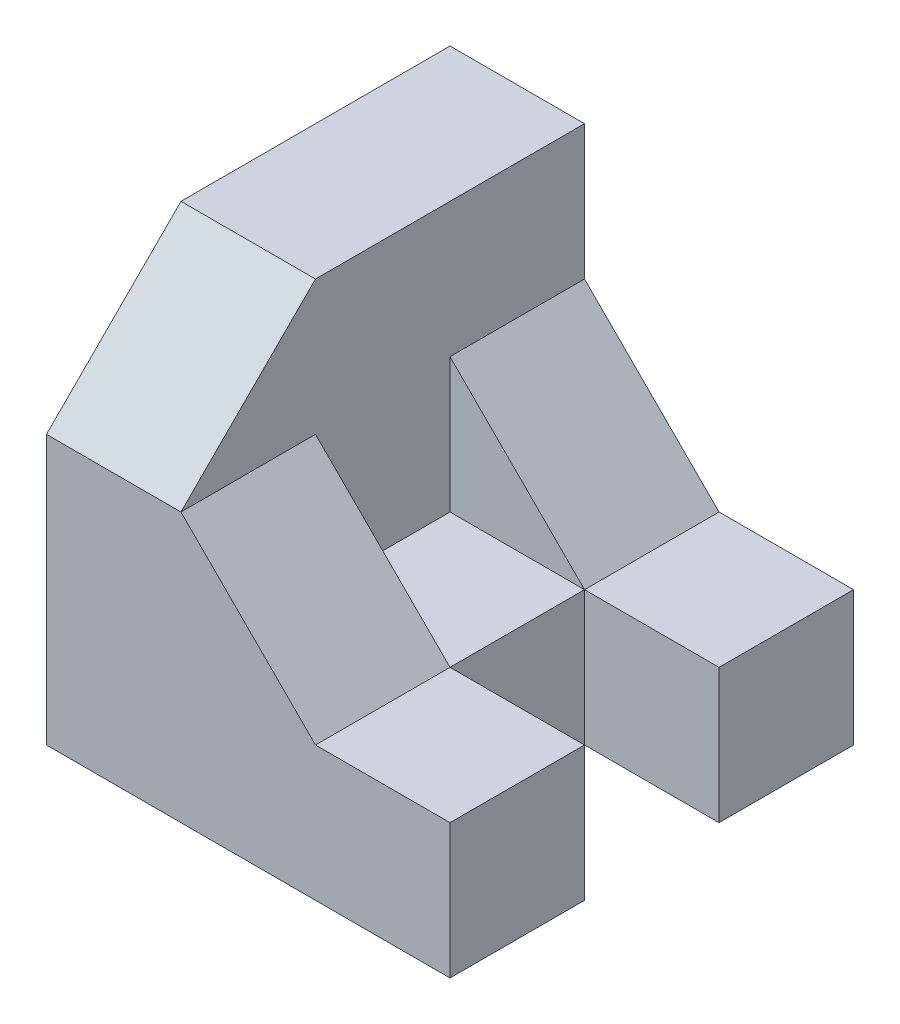
ISO-10303-21;
HEADER;
FILE_DESCRIPTION(('STEP AP214'),'2;1');
FILE_NAME('part.step','',(''),(''),'','','');
FILE_SCHEMA(('AUTOMOTIVE_DESIGN { 1 0 10303 214 1 1 1 1 }'));
ENDSEC;
DATA;
#1=APPLICATION_CONTEXT('core data for automotive mechanical design processes');
#2=APPLICATION_PROTOCOL_DEFINITION('international standard','automotive_design',2000,#1);
#3=PRODUCT_CONTEXT('',#1,'mechanical');
#4=PRODUCT('Part','Part','',(#3));
#5=PRODUCT_RELATED_PRODUCT_CATEGORY('part','',(#4));
#6=PRODUCT_DEFINITION_FORMATION('','',#4);
#7=PRODUCT_DEFINITION_CONTEXT('part definition',#1,'design');
#8=PRODUCT_DEFINITION('design','',#6,#7);
#9=PRODUCT_DEFINITION_SHAPE('','',#8);
#10=(LENGTH_UNIT() NAMED_UNIT(*) SI_UNIT(.MILLI.,.METRE.));
#11=(NAMED_UNIT(*) PLANE_ANGLE_UNIT() SI_UNIT($,.RADIAN.));
#12=(NAMED_UNIT(*) SI_UNIT($,.STERADIAN.) SOLID_ANGLE_UNIT());
#13=UNCERTAINTY_MEASURE_WITH_UNIT(LENGTH_MEASURE(1.E-05),#10,'distance_accuracy_value','');
#14=(GEOMETRIC_REPRESENTATION_CONTEXT(3) GLOBAL_UNCERTAINTY_ASSIGNED_CONTEXT((#13)) GLOBAL_UNIT_ASSIGNED_CONTEXT((#10,
#11,#12)) REPRESENTATION_CONTEXT('',''));
#15=CARTESIAN_POINT('',(0.,0.,0.));
#16=DIRECTION('',(0.,0.,1.));
#17=DIRECTION('',(1.,0.,0.));
#18=AXIS2_PLACEMENT_3D('',#15,#16,#17);
#19=CARTESIAN_POINT('',(60.,20.,-60.));
#20=DIRECTION('',(0.,1.,0.));
#21=DIRECTION('',(-1.,0.,0.));
#22=AXIS2_PLACEMENT_3D('',#19,#20,#21);
#23=PLANE('',#22);
#24=DIRECTION('',(0.,0.,1.));
#25=VECTOR('',#24,1.);
#26=CARTESIAN_POINT('',(40.,20.,-60.));
#27=LINE('',#26,#25);
#28=CARTESIAN_POINT('',(40.,20.,-60.));
#29=VERTEX_POINT('',#28);
#30=CARTESIAN_POINT('',(40.,20.,-40.));
#31=VERTEX_POINT('',#30);
#32=EDGE_CURVE('E177',#29,#31,#27,.T.);
#33=ORIENTED_EDGE('',*,*,#32,.T.);
#34=DIRECTION('',(-1.,0.,0.));
#35=VECTOR('',#34,1.);
#36=CARTESIAN_POINT('',(0.,20.,-40.));
#37=LINE('',#36,#35);
#38=CARTESIAN_POINT('',(60.,20.,-40.));
#39=VERTEX_POINT('',#38);
#40=EDGE_CURVE('E145',#39,#31,#37,.T.);
#41=ORIENTED_EDGE('',*,*,#40,.F.);
#42=DIRECTION('',(0.,0.,1.));
#43=VECTOR('',#42,1.);
#44=CARTESIAN_POINT('',(60.,20.,-60.));
#45=LINE('',#44,#43);
#46=CARTESIAN_POINT('',(60.,20.,-60.));
#47=VERTEX_POINT('',#46);
#48=EDGE_CURVE('E189',#47,#39,#45,.T.);
#49=ORIENTED_EDGE('',*,*,#48,.F.);
#50=DIRECTION('',(-1.,0.,0.));
#51=VECTOR('',#50,1.);
#52=CARTESIAN_POINT('',(60.,20.,-60.));
#53=LINE('',#52,#51);
#54=EDGE_CURVE('E184',#47,#29,#53,.T.);
#55=ORIENTED_EDGE('',*,*,#54,.T.);
#56=EDGE_LOOP('',(#33,#41,#49,#55));
#57=FACE_BOUND('',#56,.T.);
#58=ADVANCED_FACE('F33',(#57),#23,.T.);
#59=DIRECTION('',(0.,0.,1.));
#60=VECTOR('',#59,1.);
#61=CARTESIAN_POINT('',(40.,20.,-40.));
#62=LINE('',#61,#60);
#63=CARTESIAN_POINT('',(40.,20.,-20.));
#64=VERTEX_POINT('',#63);
#65=EDGE_CURVE('E138',#31,#64,#62,.T.);
#66=ORIENTED_EDGE('',*,*,#65,.F.);
#67=DIRECTION('',(1.,0.,0.));
#68=VECTOR('',#67,1.);
#69=CARTESIAN_POINT('',(0.,20.,-40.));
#70=LINE('',#69,#68);
#71=CARTESIAN_POINT('',(20.,20.,-40.));
#72=VERTEX_POINT('',#71);
#73=EDGE_CURVE('E160',#72,#31,#70,.T.);
#74=ORIENTED_EDGE('',*,*,#73,.F.);
#75=DIRECTION('',(0.,0.,1.));
#76=VECTOR('',#75,1.);
#77=CARTESIAN_POINT('',(20.,20.,-40.));
#78=LINE('',#77,#76);
#79=CARTESIAN_POINT('',(20.,20.,-20.));
#80=VERTEX_POINT('',#79);
#81=EDGE_CURVE('E180',#72,#80,#78,.T.);
#82=ORIENTED_EDGE('',*,*,#81,.T.);
#83=DIRECTION('',(1.,0.,0.));
#84=VECTOR('',#83,1.);
#85=CARTESIAN_POINT('',(0.,20.,-20.));
#86=LINE('',#85,#84);
#87=EDGE_CURVE('E163',#80,#64,#86,.T.);
#88=ORIENTED_EDGE('',*,*,#87,.T.);
#89=EDGE_LOOP('',(#66,#74,#82,#88));
#90=FACE_BOUND('',#89,.T.);
#91=ADVANCED_FACE('F159',(#90),#23,.T.);
#92=CARTESIAN_POINT('',(60.,0.,-60.));
#93=DIRECTION('',(1.,0.,0.));
#94=DIRECTION('',(0.,0.,-1.));
#95=AXIS2_PLACEMENT_3D('',#92,#93,#94);
#96=PLANE('',#95);
#97=ORIENTED_EDGE('',*,*,#48,.T.);
#98=DIRECTION('',(0.,1.,0.));
#99=VECTOR('',#98,1.);
#100=CARTESIAN_POINT('',(60.,0.,-40.));
#101=LINE('',#100,#99);
#102=CARTESIAN_POINT('',(60.,0.,-40.));
#103=VERTEX_POINT('',#102);
#104=EDGE_CURVE('E150',#103,#39,#101,.T.);
#105=ORIENTED_EDGE('',*,*,#104,.F.);
#106=DIRECTION('',(0.,0.,1.));
#107=VECTOR('',#106,1.);
#108=CARTESIAN_POINT('',(60.,0.,-60.));
#109=LINE('',#108,#107);
#110=CARTESIAN_POINT('',(60.,0.,-60.));
#111=VERTEX_POINT('',#110);
#112=EDGE_CURVE('E193',#111,#103,#109,.T.);
#113=ORIENTED_EDGE('',*,*,#112,.F.);
#114=DIRECTION('',(0.,1.,0.));
#115=VECTOR('',#114,1.);
#116=CARTESIAN_POINT('',(60.,0.,-60.));
#117=LINE('',#116,#115);
#118=EDGE_CURVE('E249',#111,#47,#117,.T.);
#119=ORIENTED_EDGE('',*,*,#118,.T.);
#120=EDGE_LOOP('',(#97,#105,#113,#119));
#121=FACE_BOUND('',#120,.T.);
#122=ADVANCED_FACE('F282',(#121),#96,.T.);
#123=CARTESIAN_POINT('',(0.,0.,-60.));
#124=DIRECTION('',(0.,-1.,0.));
#125=DIRECTION('',(0.,0.,-1.));
#126=AXIS2_PLACEMENT_3D('',#123,#124,#125);
#127=PLANE('',#126);
#128=ORIENTED_EDGE('',*,*,#112,.T.);
#129=DIRECTION('',(1.,0.,0.));
#130=VECTOR('',#129,1.);
#131=CARTESIAN_POINT('',(0.,0.,-40.));
#132=LINE('',#131,#130);
#133=CARTESIAN_POINT('',(40.,0.,-40.));
#134=VERTEX_POINT('',#133);
#135=EDGE_CURVE('E144',#134,#103,#132,.T.);
#136=ORIENTED_EDGE('',*,*,#135,.F.);
#137=DIRECTION('',(0.,0.,1.));
#138=VECTOR('',#137,1.);
#139=CARTESIAN_POINT('',(40.,0.,-40.));
#140=LINE('',#139,#138);
#141=CARTESIAN_POINT('',(40.,0.,-20.));
#142=VERTEX_POINT('',#141);
#143=EDGE_CURVE('E141',#134,#142,#140,.T.);
#144=ORIENTED_EDGE('',*,*,#143,.T.);
#145=DIRECTION('',(1.,0.,0.));
#146=VECTOR('',#145,1.);
#147=CARTESIAN_POINT('',(0.,0.,-20.));
#148=LINE('',#147,#146);
#149=CARTESIAN_POINT('',(60.,0.,-20.));
#150=VERTEX_POINT('',#149);
#151=EDGE_CURVE('E273',#142,#150,#148,.T.);
#152=ORIENTED_EDGE('',*,*,#151,.T.);
#153=CARTESIAN_POINT('',(60.,0.,0.));
#154=VERTEX_POINT('',#153);
#155=EDGE_CURVE('E195',#150,#154,#109,.T.);
#156=ORIENTED_EDGE('',*,*,#155,.T.);
#157=DIRECTION('',(1.,0.,0.));
#158=VECTOR('',#157,1.);
#159=CARTESIAN_POINT('',(0.,0.,0.));
#160=LINE('',#159,#158);
#161=CARTESIAN_POINT('',(0.,0.,0.));
#162=VERTEX_POINT('',#161);
#163=EDGE_CURVE('E218',#162,#154,#160,.T.);
#164=ORIENTED_EDGE('',*,*,#163,.F.);
#165=DIRECTION('',(0.,0.,1.));
#166=VECTOR('',#165,1.);
#167=CARTESIAN_POINT('',(0.,0.,-60.));
#168=LINE('',#167,#166);
#169=CARTESIAN_POINT('',(0.,0.,-60.));
#170=VERTEX_POINT('',#169);
#171=EDGE_CURVE('E37',#170,#162,#168,.T.);
#172=ORIENTED_EDGE('',*,*,#171,.F.);
#173=DIRECTION('',(1.,0.,0.));
#174=VECTOR('',#173,1.);
#175=CARTESIAN_POINT('',(0.,0.,-60.));
#176=LINE('',#175,#174);
#177=EDGE_CURVE('E247',#170,#111,#176,.T.);
#178=ORIENTED_EDGE('',*,*,#177,.T.);
#179=EDGE_LOOP('',(#128,#136,#144,#152,#156,#164,#172,#178));
#180=FACE_BOUND('',#179,.T.);
#181=ADVANCED_FACE('F283',(#180),#127,.T.);
#182=CARTESIAN_POINT('',(40.,20.,-60.));
#183=DIRECTION('',(0.707106781186548,0.707106781186547,0.));
#184=DIRECTION('',(-0.707106781186547,0.707106781186548,0.));
#185=AXIS2_PLACEMENT_3D('',#182,#183,#184);
#186=PLANE('',#185);
#187=DIRECTION('',(0.,0.,1.));
#188=VECTOR('',#187,1.);
#189=CARTESIAN_POINT('',(20.,40.,-60.));
#190=LINE('',#189,#188);
#191=CARTESIAN_POINT('',(20.,40.,-60.));
#192=VERTEX_POINT('',#191);
#193=CARTESIAN_POINT('',(20.,40.,-40.));
#194=VERTEX_POINT('',#193);
#195=EDGE_CURVE('E179',#192,#194,#190,.T.);
#196=ORIENTED_EDGE('',*,*,#195,.T.);
#197=DIRECTION('',(-0.707106781186547,0.707106781186548,0.));
#198=VECTOR('',#197,1.);
#199=CARTESIAN_POINT('',(30.,30.,-40.));
#200=LINE('',#199,#198);
#201=EDGE_CURVE('E170',#31,#194,#200,.T.);
#202=ORIENTED_EDGE('',*,*,#201,.F.);
#203=ORIENTED_EDGE('',*,*,#32,.F.);
#204=DIRECTION('',(-0.707106781186547,0.707106781186548,0.));
#205=VECTOR('',#204,1.);
#206=CARTESIAN_POINT('',(40.,20.,-60.));
#207=LINE('',#206,#205);
#208=EDGE_CURVE('E212',#29,#192,#207,.T.);
#209=ORIENTED_EDGE('',*,*,#208,.T.);
#210=EDGE_LOOP('',(#196,#202,#203,#209));
#211=FACE_BOUND('',#210,.T.);
#212=ADVANCED_FACE('F175',(#211),#186,.T.);
#213=CARTESIAN_POINT('',(0.,60.,-60.));
#214=DIRECTION('',(-1.,0.,0.));
#215=DIRECTION('',(0.,-1.,0.));
#216=AXIS2_PLACEMENT_3D('',#213,#214,#215);
#217=PLANE('',#216);
#218=DIRECTION('',(0.,0.707106781186548,-0.707106781186547));
#219=VECTOR('',#218,1.);
#220=CARTESIAN_POINT('',(0.,40.,0.));
#221=LINE('',#220,#219);
#222=CARTESIAN_POINT('',(0.,40.,0.));
#223=VERTEX_POINT('',#222);
#224=CARTESIAN_POINT('',(0.,60.,-20.));
#225=VERTEX_POINT('',#224);
#226=EDGE_CURVE('E58',#223,#225,#221,.T.);
#227=ORIENTED_EDGE('',*,*,#226,.T.);
#228=DIRECTION('',(0.,0.,1.));
#229=VECTOR('',#228,1.);
#230=CARTESIAN_POINT('',(0.,60.,-60.));
#231=LINE('',#230,#229);
#232=CARTESIAN_POINT('',(0.,60.,-60.));
#233=VERTEX_POINT('',#232);
#234=EDGE_CURVE('E11',#233,#225,#231,.T.);
#235=ORIENTED_EDGE('',*,*,#234,.F.);
#236=DIRECTION('',(0.,-1.,0.));
#237=VECTOR('',#236,1.);
#238=CARTESIAN_POINT('',(0.,60.,-60.));
#239=LINE('',#238,#237);
#240=EDGE_CURVE('E230',#233,#170,#239,.T.);
#241=ORIENTED_EDGE('',*,*,#240,.T.);
#242=ORIENTED_EDGE('',*,*,#171,.T.);
#243=DIRECTION('',(0.,-1.,0.));
#244=VECTOR('',#243,1.);
#245=CARTESIAN_POINT('',(0.,60.,0.));
#246=LINE('',#245,#244);
#247=EDGE_CURVE('E216',#223,#162,#246,.T.);
#248=ORIENTED_EDGE('',*,*,#247,.F.);
#249=EDGE_LOOP('',(#227,#235,#241,#242,#248));
#250=FACE_BOUND('',#249,.T.);
#251=ADVANCED_FACE('F35',(#250),#217,.T.);
#252=CARTESIAN_POINT('',(20.,60.,-60.));
#253=DIRECTION('',(0.,1.,0.));
#254=DIRECTION('',(0.,0.,1.));
#255=AXIS2_PLACEMENT_3D('',#252,#253,#254);
#256=PLANE('',#255);
#257=DIRECTION('',(1.,0.,0.));
#258=VECTOR('',#257,1.);
#259=CARTESIAN_POINT('',(-28.2842712474619,60.,-20.));
#260=LINE('',#259,#258);
#261=CARTESIAN_POINT('',(20.,60.,-20.));
#262=VERTEX_POINT('',#261);
#263=EDGE_CURVE('E240',#225,#262,#260,.T.);
#264=ORIENTED_EDGE('',*,*,#263,.T.);
#265=DIRECTION('',(0.,0.,1.));
#266=VECTOR('',#265,1.);
#267=CARTESIAN_POINT('',(20.,60.,-60.));
#268=LINE('',#267,#266);
#269=CARTESIAN_POINT('',(20.,60.,-60.));
#270=VERTEX_POINT('',#269);
#271=EDGE_CURVE('E42',#270,#262,#268,.T.);
#272=ORIENTED_EDGE('',*,*,#271,.F.);
#273=DIRECTION('',(-1.,0.,0.));
#274=VECTOR('',#273,1.);
#275=CARTESIAN_POINT('',(20.,60.,-60.));
#276=LINE('',#275,#274);
#277=EDGE_CURVE('E202',#270,#233,#276,.T.);
#278=ORIENTED_EDGE('',*,*,#277,.T.);
#279=ORIENTED_EDGE('',*,*,#234,.T.);
#280=EDGE_LOOP('',(#264,#272,#278,#279));
#281=FACE_BOUND('',#280,.T.);
#282=ADVANCED_FACE('F239',(#281),#256,.T.);
#283=CARTESIAN_POINT('',(20.,40.,-60.));
#284=DIRECTION('',(1.,0.,0.));
#285=DIRECTION('',(0.,1.,0.));
#286=AXIS2_PLACEMENT_3D('',#283,#284,#285);
#287=PLANE('',#286);
#288=DIRECTION('',(0.,0.707106781186548,-0.707106781186547));
#289=VECTOR('',#288,1.);
#290=CARTESIAN_POINT('',(20.,40.,0.));
#291=LINE('',#290,#289);
#292=CARTESIAN_POINT('',(20.,40.,0.));
#293=VERTEX_POINT('',#292);
#294=EDGE_CURVE('E236',#293,#262,#291,.T.);
#295=ORIENTED_EDGE('',*,*,#294,.F.);
#296=CARTESIAN_POINT('',(20.,40.,-20.));
#297=VERTEX_POINT('',#296);
#298=EDGE_CURVE('E185',#297,#293,#190,.T.);
#299=ORIENTED_EDGE('',*,*,#298,.F.);
#300=DIRECTION('',(0.,-1.,0.));
#301=VECTOR('',#300,1.);
#302=CARTESIAN_POINT('',(20.,0.,-20.));
#303=LINE('',#302,#301);
#304=EDGE_CURVE('E267',#297,#80,#303,.T.);
#305=ORIENTED_EDGE('',*,*,#304,.T.);
#306=ORIENTED_EDGE('',*,*,#81,.F.);
#307=DIRECTION('',(0.,-1.,0.));
#308=VECTOR('',#307,1.);
#309=CARTESIAN_POINT('',(20.,0.,-40.));
#310=LINE('',#309,#308);
#311=EDGE_CURVE('E172',#194,#72,#310,.T.);
#312=ORIENTED_EDGE('',*,*,#311,.F.);
#313=ORIENTED_EDGE('',*,*,#195,.F.);
#314=DIRECTION('',(0.,1.,0.));
#315=VECTOR('',#314,1.);
#316=CARTESIAN_POINT('',(20.,40.,-60.));
#317=LINE('',#316,#315);
#318=EDGE_CURVE('E207',#192,#270,#317,.T.);
#319=ORIENTED_EDGE('',*,*,#318,.T.);
#320=ORIENTED_EDGE('',*,*,#271,.T.);
#321=EDGE_LOOP('',(#295,#299,#305,#306,#312,#313,#319,#320));
#322=FACE_BOUND('',#321,.T.);
#323=ADVANCED_FACE('F234',(#322),#287,.T.);
#324=DIRECTION('',(-0.707106781186547,0.707106781186548,0.));
#325=VECTOR('',#324,1.);
#326=CARTESIAN_POINT('',(30.,30.,-20.));
#327=LINE('',#326,#325);
#328=EDGE_CURVE('E263',#64,#297,#327,.T.);
#329=ORIENTED_EDGE('',*,*,#328,.T.);
#330=ORIENTED_EDGE('',*,*,#298,.T.);
#331=DIRECTION('',(-0.707106781186547,0.707106781186548,0.));
#332=VECTOR('',#331,1.);
#333=CARTESIAN_POINT('',(40.,20.,0.));
#334=LINE('',#333,#332);
#335=CARTESIAN_POINT('',(40.,20.,0.));
#336=VERTEX_POINT('',#335);
#337=EDGE_CURVE('E228',#336,#293,#334,.T.);
#338=ORIENTED_EDGE('',*,*,#337,.F.);
#339=EDGE_CURVE('E186',#64,#336,#27,.T.);
#340=ORIENTED_EDGE('',*,*,#339,.F.);
#341=EDGE_LOOP('',(#329,#330,#338,#340));
#342=FACE_BOUND('',#341,.T.);
#343=ADVANCED_FACE('F290',(#342),#186,.T.);
#344=DIRECTION('',(-1.,0.,0.));
#345=VECTOR('',#344,1.);
#346=CARTESIAN_POINT('',(0.,20.,-20.));
#347=LINE('',#346,#345);
#348=CARTESIAN_POINT('',(60.,20.,-20.));
#349=VERTEX_POINT('',#348);
#350=EDGE_CURVE('E277',#349,#64,#347,.T.);
#351=ORIENTED_EDGE('',*,*,#350,.T.);
#352=ORIENTED_EDGE('',*,*,#339,.T.);
#353=DIRECTION('',(-1.,0.,0.));
#354=VECTOR('',#353,1.);
#355=CARTESIAN_POINT('',(60.,20.,0.));
#356=LINE('',#355,#354);
#357=CARTESIAN_POINT('',(60.,20.,0.));
#358=VERTEX_POINT('',#357);
#359=EDGE_CURVE('E225',#358,#336,#356,.T.);
#360=ORIENTED_EDGE('',*,*,#359,.F.);
#361=EDGE_CURVE('E192',#349,#358,#45,.T.);
#362=ORIENTED_EDGE('',*,*,#361,.F.);
#363=EDGE_LOOP('',(#351,#352,#360,#362));
#364=FACE_BOUND('',#363,.T.);
#365=ADVANCED_FACE('F295',(#364),#23,.T.);
#366=DIRECTION('',(0.,1.,0.));
#367=VECTOR('',#366,1.);
#368=CARTESIAN_POINT('',(60.,0.,-20.));
#369=LINE('',#368,#367);
#370=EDGE_CURVE('E50',#150,#349,#369,.T.);
#371=ORIENTED_EDGE('',*,*,#370,.T.);
#372=ORIENTED_EDGE('',*,*,#361,.T.);
#373=DIRECTION('',(0.,1.,0.));
#374=VECTOR('',#373,1.);
#375=CARTESIAN_POINT('',(60.,0.,0.));
#376=LINE('',#375,#374);
#377=EDGE_CURVE('E222',#154,#358,#376,.T.);
#378=ORIENTED_EDGE('',*,*,#377,.F.);
#379=ORIENTED_EDGE('',*,*,#155,.F.);
#380=EDGE_LOOP('',(#371,#372,#378,#379));
#381=FACE_BOUND('',#380,.T.);
#382=ADVANCED_FACE('F292',(#381),#96,.T.);
#383=CARTESIAN_POINT('',(0.,0.,-60.));
#384=DIRECTION('',(0.,0.,1.));
#385=DIRECTION('',(1.,0.,0.));
#386=AXIS2_PLACEMENT_3D('',#383,#384,#385);
#387=PLANE('',#386);
#388=ORIENTED_EDGE('',*,*,#240,.F.);
#389=ORIENTED_EDGE('',*,*,#277,.F.);
#390=ORIENTED_EDGE('',*,*,#318,.F.);
#391=ORIENTED_EDGE('',*,*,#208,.F.);
#392=ORIENTED_EDGE('',*,*,#54,.F.);
#393=ORIENTED_EDGE('',*,*,#118,.F.);
#394=ORIENTED_EDGE('',*,*,#177,.F.);
#395=EDGE_LOOP('',(#388,#389,#390,#391,#392,#393,#394));
#396=FACE_BOUND('',#395,.T.);
#397=ADVANCED_FACE('F254',(#396),#387,.F.);
#398=CARTESIAN_POINT('',(0.,0.,0.));
#399=DIRECTION('',(0.,0.,1.));
#400=DIRECTION('',(1.,0.,0.));
#401=AXIS2_PLACEMENT_3D('',#398,#399,#400);
#402=PLANE('',#401);
#403=DIRECTION('',(1.,0.,0.));
#404=VECTOR('',#403,1.);
#405=CARTESIAN_POINT('',(-28.2842712474619,40.,0.));
#406=LINE('',#405,#404);
#407=EDGE_CURVE('E219',#223,#293,#406,.T.);
#408=ORIENTED_EDGE('',*,*,#407,.F.);
#409=ORIENTED_EDGE('',*,*,#247,.T.);
#410=ORIENTED_EDGE('',*,*,#163,.T.);
#411=ORIENTED_EDGE('',*,*,#377,.T.);
#412=ORIENTED_EDGE('',*,*,#359,.T.);
#413=ORIENTED_EDGE('',*,*,#337,.T.);
#414=EDGE_LOOP('',(#408,#409,#410,#411,#412,#413));
#415=FACE_BOUND('',#414,.T.);
#416=ADVANCED_FACE('F258',(#415),#402,.T.);
#417=CARTESIAN_POINT('',(-28.2842712474619,40.,0.));
#418=DIRECTION('',(0.,-0.707106781186547,-0.707106781186548));
#419=DIRECTION('',(0.,0.707106781186548,-0.707106781186547));
#420=AXIS2_PLACEMENT_3D('',#417,#418,#419);
#421=PLANE('',#420);
#422=ORIENTED_EDGE('',*,*,#407,.T.);
#423=ORIENTED_EDGE('',*,*,#294,.T.);
#424=ORIENTED_EDGE('',*,*,#263,.F.);
#425=ORIENTED_EDGE('',*,*,#226,.F.);
#426=EDGE_LOOP('',(#422,#423,#424,#425));
#427=FACE_BOUND('',#426,.T.);
#428=ADVANCED_FACE('F260',(#427),#421,.F.);
#429=CARTESIAN_POINT('',(0.,0.,-40.));
#430=DIRECTION('',(0.,0.,1.));
#431=DIRECTION('',(1.,0.,0.));
#432=AXIS2_PLACEMENT_3D('',#429,#430,#431);
#433=PLANE('',#432);
#434=ORIENTED_EDGE('',*,*,#311,.T.);
#435=ORIENTED_EDGE('',*,*,#73,.T.);
#436=ORIENTED_EDGE('',*,*,#201,.T.);
#437=EDGE_LOOP('',(#434,#435,#436));
#438=FACE_BOUND('',#437,.T.);
#439=ADVANCED_FACE('F169',(#438),#433,.T.);
#440=CARTESIAN_POINT('',(0.,0.,-20.));
#441=DIRECTION('',(0.,0.,1.));
#442=DIRECTION('',(1.,0.,0.));
#443=AXIS2_PLACEMENT_3D('',#440,#441,#442);
#444=PLANE('',#443);
#445=ORIENTED_EDGE('',*,*,#304,.F.);
#446=ORIENTED_EDGE('',*,*,#328,.F.);
#447=ORIENTED_EDGE('',*,*,#87,.F.);
#448=EDGE_LOOP('',(#445,#446,#447));
#449=FACE_BOUND('',#448,.T.);
#450=ADVANCED_FACE('F311',(#449),#444,.F.);
#451=CARTESIAN_POINT('',(40.,0.,-40.));
#452=DIRECTION('',(-1.,0.,0.));
#453=DIRECTION('',(0.,0.,1.));
#454=AXIS2_PLACEMENT_3D('',#451,#452,#453);
#455=PLANE('',#454);
#456=DIRECTION('',(0.,-1.,0.));
#457=VECTOR('',#456,1.);
#458=CARTESIAN_POINT('',(40.,0.,-20.));
#459=LINE('',#458,#457);
#460=EDGE_CURVE('E275',#64,#142,#459,.T.);
#461=ORIENTED_EDGE('',*,*,#460,.T.);
#462=ORIENTED_EDGE('',*,*,#143,.F.);
#463=DIRECTION('',(0.,-1.,0.));
#464=VECTOR('',#463,1.);
#465=CARTESIAN_POINT('',(40.,0.,-40.));
#466=LINE('',#465,#464);
#467=EDGE_CURVE('E133',#31,#134,#466,.T.);
#468=ORIENTED_EDGE('',*,*,#467,.F.);
#469=ORIENTED_EDGE('',*,*,#65,.T.);
#470=EDGE_LOOP('',(#461,#462,#468,#469));
#471=FACE_BOUND('',#470,.T.);
#472=ADVANCED_FACE('F136',(#471),#455,.F.);
#473=CARTESIAN_POINT('',(0.,0.,-40.));
#474=DIRECTION('',(0.,0.,1.));
#475=DIRECTION('',(1.,0.,0.));
#476=AXIS2_PLACEMENT_3D('',#473,#474,#475);
#477=PLANE('',#476);
#478=ORIENTED_EDGE('',*,*,#40,.T.);
#479=ORIENTED_EDGE('',*,*,#467,.T.);
#480=ORIENTED_EDGE('',*,*,#135,.T.);
#481=ORIENTED_EDGE('',*,*,#104,.T.);
#482=EDGE_LOOP('',(#478,#479,#480,#481));
#483=FACE_BOUND('',#482,.T.);
#484=ADVANCED_FACE('F148',(#483),#477,.T.);
#485=CARTESIAN_POINT('',(0.,0.,-20.));
#486=DIRECTION('',(0.,0.,1.));
#487=DIRECTION('',(1.,0.,0.));
#488=AXIS2_PLACEMENT_3D('',#485,#486,#487);
#489=PLANE('',#488);
#490=ORIENTED_EDGE('',*,*,#350,.F.);
#491=ORIENTED_EDGE('',*,*,#370,.F.);
#492=ORIENTED_EDGE('',*,*,#151,.F.);
#493=ORIENTED_EDGE('',*,*,#460,.F.);
#494=EDGE_LOOP('',(#490,#491,#492,#493));
#495=FACE_BOUND('',#494,.T.);
#496=ADVANCED_FACE('F378',(#495),#489,.F.);
#497=CLOSED_SHELL('',(#58,#91,#122,#181,#212,#251,#282,#323,#343,#365,#382,#397,#416,#428,#439,
#450,#472,#484,#496));
#498=MANIFOLD_SOLID_BREP('B2',#497);
#499=ADVANCED_BREP_SHAPE_REPRESENTATION('',(#18,#498),#14);
#500=SHAPE_DEFINITION_REPRESENTATION(#9,#499);
ENDSEC;
END-ISO-10303-21;
